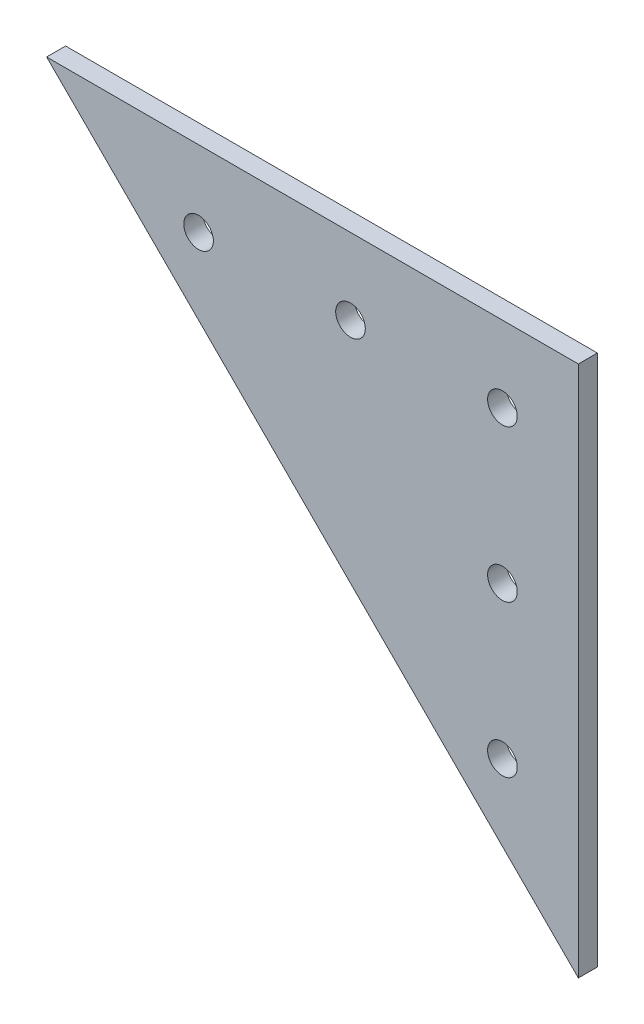
ISO-10303-21;
HEADER;
FILE_DESCRIPTION(('STEP AP214'),'2;1');
FILE_NAME('part.step','',(''),(''),'','','');
FILE_SCHEMA(('AUTOMOTIVE_DESIGN { 1 0 10303 214 1 1 1 1 }'));
ENDSEC;
DATA;
#1=APPLICATION_CONTEXT('core data for automotive mechanical design processes');
#2=APPLICATION_PROTOCOL_DEFINITION('international standard','automotive_design',2000,#1);
#3=PRODUCT_CONTEXT('',#1,'mechanical');
#4=PRODUCT('Part','Part','',(#3));
#5=PRODUCT_RELATED_PRODUCT_CATEGORY('part','',(#4));
#6=PRODUCT_DEFINITION_FORMATION('','',#4);
#7=PRODUCT_DEFINITION_CONTEXT('part definition',#1,'design');
#8=PRODUCT_DEFINITION('design','',#6,#7);
#9=PRODUCT_DEFINITION_SHAPE('','',#8);
#10=(LENGTH_UNIT() NAMED_UNIT(*) SI_UNIT(.MILLI.,.METRE.));
#11=(NAMED_UNIT(*) PLANE_ANGLE_UNIT() SI_UNIT($,.RADIAN.));
#12=(NAMED_UNIT(*) SI_UNIT($,.STERADIAN.) SOLID_ANGLE_UNIT());
#13=UNCERTAINTY_MEASURE_WITH_UNIT(LENGTH_MEASURE(1.E-05),#10,'distance_accuracy_value','');
#14=(GEOMETRIC_REPRESENTATION_CONTEXT(3) GLOBAL_UNCERTAINTY_ASSIGNED_CONTEXT((#13)) GLOBAL_UNIT_ASSIGNED_CONTEXT((#10,
#11,#12)) REPRESENTATION_CONTEXT('',''));
#15=CARTESIAN_POINT('',(0.,0.,0.));
#16=DIRECTION('',(0.,0.,1.));
#17=DIRECTION('',(1.,0.,0.));
#18=AXIS2_PLACEMENT_3D('',#15,#16,#17);
#19=CARTESIAN_POINT('',(0.,0.,1.5875));
#20=DIRECTION('',(0.,0.,-1.));
#21=DIRECTION('',(-1.,0.,0.));
#22=AXIS2_PLACEMENT_3D('',#19,#20,#21);
#23=PLANE('',#22);
#24=DIRECTION('',(0.707106781186547,-0.707106781186547,0.));
#25=VECTOR('',#24,1.);
#26=CARTESIAN_POINT('',(-44.45,44.45,1.5875));
#27=LINE('',#26,#25);
#28=CARTESIAN_POINT('',(-44.45,44.45,1.5875));
#29=VERTEX_POINT('',#28);
#30=CARTESIAN_POINT('',(44.45,-44.45,1.5875));
#31=VERTEX_POINT('',#30);
#32=EDGE_CURVE('E73',#29,#31,#27,.T.);
#33=ORIENTED_EDGE('',*,*,#32,.T.);
#34=DIRECTION('',(0.,1.,0.));
#35=VECTOR('',#34,1.);
#36=CARTESIAN_POINT('',(44.45,44.45,1.5875));
#37=LINE('',#36,#35);
#38=CARTESIAN_POINT('',(44.45,44.45,1.5875));
#39=VERTEX_POINT('',#38);
#40=EDGE_CURVE('E69',#31,#39,#37,.T.);
#41=ORIENTED_EDGE('',*,*,#40,.T.);
#42=DIRECTION('',(-1.,0.,0.));
#43=VECTOR('',#42,1.);
#44=CARTESIAN_POINT('',(-44.45,44.45,1.5875));
#45=LINE('',#44,#43);
#46=EDGE_CURVE('E49',#39,#29,#45,.T.);
#47=ORIENTED_EDGE('',*,*,#46,.T.);
#48=EDGE_LOOP('',(#33,#41,#47));
#49=FACE_BOUND('',#48,.T.);
#50=CARTESIAN_POINT('',(6.34999999999997,31.75,1.5875));
#51=DIRECTION('',(0.,0.,1.));
#52=DIRECTION('',(1.,0.,0.));
#53=AXIS2_PLACEMENT_3D('',#50,#51,#52);
#54=CIRCLE('',#53,2.4765);
#55=CARTESIAN_POINT('',(8.82649999999997,31.75,1.5875));
#56=VERTEX_POINT('',#55);
#57=EDGE_CURVE('E83',#56,#56,#54,.T.);
#58=ORIENTED_EDGE('',*,*,#57,.F.);
#59=EDGE_LOOP('',(#58));
#60=FACE_BOUND('',#59,.T.);
#61=CARTESIAN_POINT('',(31.75,31.75,1.5875));
#62=DIRECTION('',(0.,0.,1.));
#63=DIRECTION('',(1.,0.,0.));
#64=AXIS2_PLACEMENT_3D('',#61,#62,#63);
#65=CIRCLE('',#64,2.47649999999999);
#66=CARTESIAN_POINT('',(34.2265,31.75,1.5875));
#67=VERTEX_POINT('',#66);
#68=EDGE_CURVE('E125',#67,#67,#65,.T.);
#69=ORIENTED_EDGE('',*,*,#68,.F.);
#70=EDGE_LOOP('',(#69));
#71=FACE_BOUND('',#70,.T.);
#72=CARTESIAN_POINT('',(31.75,6.35,1.5875));
#73=DIRECTION('',(0.,0.,1.));
#74=DIRECTION('',(1.,0.,0.));
#75=AXIS2_PLACEMENT_3D('',#72,#73,#74);
#76=CIRCLE('',#75,2.47649999999999);
#77=CARTESIAN_POINT('',(34.2265,6.35,1.5875));
#78=VERTEX_POINT('',#77);
#79=EDGE_CURVE('E120',#78,#78,#76,.T.);
#80=ORIENTED_EDGE('',*,*,#79,.F.);
#81=EDGE_LOOP('',(#80));
#82=FACE_BOUND('',#81,.T.);
#83=CARTESIAN_POINT('',(31.75,-19.05,1.5875));
#84=DIRECTION('',(0.,0.,1.));
#85=DIRECTION('',(1.,0.,0.));
#86=AXIS2_PLACEMENT_3D('',#83,#84,#85);
#87=CIRCLE('',#86,2.4765);
#88=CARTESIAN_POINT('',(34.2265,-19.05,1.5875));
#89=VERTEX_POINT('',#88);
#90=EDGE_CURVE('E115',#89,#89,#87,.T.);
#91=ORIENTED_EDGE('',*,*,#90,.F.);
#92=EDGE_LOOP('',(#91));
#93=FACE_BOUND('',#92,.T.);
#94=CARTESIAN_POINT('',(-19.05,31.75,1.5875));
#95=DIRECTION('',(0.,0.,1.));
#96=DIRECTION('',(1.,0.,0.));
#97=AXIS2_PLACEMENT_3D('',#94,#95,#96);
#98=CIRCLE('',#97,2.4765);
#99=CARTESIAN_POINT('',(-16.5735,31.75,1.5875));
#100=VERTEX_POINT('',#99);
#101=EDGE_CURVE('E109',#100,#100,#98,.T.);
#102=ORIENTED_EDGE('',*,*,#101,.F.);
#103=EDGE_LOOP('',(#102));
#104=FACE_BOUND('',#103,.T.);
#105=ADVANCED_FACE('F32',(#49,#60,#71,#82,#93,#104),#23,.F.);
#106=CARTESIAN_POINT('',(0.,0.,-1.5875));
#107=DIRECTION('',(0.,0.,-1.));
#108=DIRECTION('',(-1.,0.,0.));
#109=AXIS2_PLACEMENT_3D('',#106,#107,#108);
#110=PLANE('',#109);
#111=CARTESIAN_POINT('',(31.75,-19.05,-1.5875));
#112=DIRECTION('',(0.,0.,1.));
#113=DIRECTION('',(1.,0.,0.));
#114=AXIS2_PLACEMENT_3D('',#111,#112,#113);
#115=CIRCLE('',#114,2.4765);
#116=CARTESIAN_POINT('',(34.2265,-19.05,-1.5875));
#117=VERTEX_POINT('',#116);
#118=EDGE_CURVE('E112',#117,#117,#115,.T.);
#119=ORIENTED_EDGE('',*,*,#118,.T.);
#120=EDGE_LOOP('',(#119));
#121=FACE_BOUND('',#120,.T.);
#122=CARTESIAN_POINT('',(31.75,31.75,-1.5875));
#123=DIRECTION('',(0.,0.,1.));
#124=DIRECTION('',(1.,0.,0.));
#125=AXIS2_PLACEMENT_3D('',#122,#123,#124);
#126=CIRCLE('',#125,2.47649999999999);
#127=CARTESIAN_POINT('',(34.2265,31.75,-1.5875));
#128=VERTEX_POINT('',#127);
#129=EDGE_CURVE('E123',#128,#128,#126,.T.);
#130=ORIENTED_EDGE('',*,*,#129,.T.);
#131=EDGE_LOOP('',(#130));
#132=FACE_BOUND('',#131,.T.);
#133=DIRECTION('',(0.707106781186547,-0.707106781186547,0.));
#134=VECTOR('',#133,1.);
#135=CARTESIAN_POINT('',(-44.45,44.45,-1.5875));
#136=LINE('',#135,#134);
#137=CARTESIAN_POINT('',(-44.45,44.45,-1.5875));
#138=VERTEX_POINT('',#137);
#139=CARTESIAN_POINT('',(44.45,-44.45,-1.5875));
#140=VERTEX_POINT('',#139);
#141=EDGE_CURVE('E80',#138,#140,#136,.T.);
#142=ORIENTED_EDGE('',*,*,#141,.F.);
#143=DIRECTION('',(-1.,0.,0.));
#144=VECTOR('',#143,1.);
#145=CARTESIAN_POINT('',(-44.45,44.45,-1.5875));
#146=LINE('',#145,#144);
#147=CARTESIAN_POINT('',(44.45,44.45,-1.5875));
#148=VERTEX_POINT('',#147);
#149=EDGE_CURVE('E66',#148,#138,#146,.T.);
#150=ORIENTED_EDGE('',*,*,#149,.F.);
#151=DIRECTION('',(0.,1.,0.));
#152=VECTOR('',#151,1.);
#153=CARTESIAN_POINT('',(44.45,44.45,-1.5875));
#154=LINE('',#153,#152);
#155=EDGE_CURVE('E61',#140,#148,#154,.T.);
#156=ORIENTED_EDGE('',*,*,#155,.F.);
#157=EDGE_LOOP('',(#142,#150,#156));
#158=FACE_BOUND('',#157,.T.);
#159=CARTESIAN_POINT('',(6.34999999999997,31.75,-1.5875));
#160=DIRECTION('',(0.,0.,1.));
#161=DIRECTION('',(1.,0.,0.));
#162=AXIS2_PLACEMENT_3D('',#159,#160,#161);
#163=CIRCLE('',#162,2.4765);
#164=CARTESIAN_POINT('',(8.82649999999997,31.75,-1.5875));
#165=VERTEX_POINT('',#164);
#166=EDGE_CURVE('E87',#165,#165,#163,.T.);
#167=ORIENTED_EDGE('',*,*,#166,.T.);
#168=EDGE_LOOP('',(#167));
#169=FACE_BOUND('',#168,.T.);
#170=CARTESIAN_POINT('',(31.75,6.35,-1.5875));
#171=DIRECTION('',(0.,0.,1.));
#172=DIRECTION('',(1.,0.,0.));
#173=AXIS2_PLACEMENT_3D('',#170,#171,#172);
#174=CIRCLE('',#173,2.47649999999999);
#175=CARTESIAN_POINT('',(34.2265,6.35,-1.5875));
#176=VERTEX_POINT('',#175);
#177=EDGE_CURVE('E104',#176,#176,#174,.T.);
#178=ORIENTED_EDGE('',*,*,#177,.T.);
#179=EDGE_LOOP('',(#178));
#180=FACE_BOUND('',#179,.T.);
#181=CARTESIAN_POINT('',(-19.05,31.75,-1.5875));
#182=DIRECTION('',(0.,0.,1.));
#183=DIRECTION('',(1.,0.,0.));
#184=AXIS2_PLACEMENT_3D('',#181,#182,#183);
#185=CIRCLE('',#184,2.4765);
#186=CARTESIAN_POINT('',(-16.5735,31.75,-1.5875));
#187=VERTEX_POINT('',#186);
#188=EDGE_CURVE('E107',#187,#187,#185,.T.);
#189=ORIENTED_EDGE('',*,*,#188,.T.);
#190=EDGE_LOOP('',(#189));
#191=FACE_BOUND('',#190,.T.);
#192=ADVANCED_FACE('F93',(#121,#132,#158,#169,#180,#191),#110,.T.);
#193=CARTESIAN_POINT('',(-44.45,44.45,1.5875));
#194=DIRECTION('',(0.707106781186548,0.707106781186548,0.));
#195=DIRECTION('',(-0.707106781186548,0.707106781186548,0.));
#196=AXIS2_PLACEMENT_3D('',#193,#194,#195);
#197=PLANE('',#196);
#198=ORIENTED_EDGE('',*,*,#141,.T.);
#199=DIRECTION('',(0.,0.,-1.));
#200=VECTOR('',#199,1.);
#201=CARTESIAN_POINT('',(44.45,-44.45,1.5875));
#202=LINE('',#201,#200);
#203=EDGE_CURVE('E11',#31,#140,#202,.T.);
#204=ORIENTED_EDGE('',*,*,#203,.F.);
#205=ORIENTED_EDGE('',*,*,#32,.F.);
#206=DIRECTION('',(0.,0.,-1.));
#207=VECTOR('',#206,1.);
#208=CARTESIAN_POINT('',(-44.45,44.45,1.5875));
#209=LINE('',#208,#207);
#210=EDGE_CURVE('E81',#29,#138,#209,.T.);
#211=ORIENTED_EDGE('',*,*,#210,.T.);
#212=EDGE_LOOP('',(#198,#204,#205,#211));
#213=FACE_BOUND('',#212,.T.);
#214=ADVANCED_FACE('F34',(#213),#197,.F.);
#215=CARTESIAN_POINT('',(44.45,44.45,1.5875));
#216=DIRECTION('',(-1.,0.,0.));
#217=DIRECTION('',(0.,0.,1.));
#218=AXIS2_PLACEMENT_3D('',#215,#216,#217);
#219=PLANE('',#218);
#220=ORIENTED_EDGE('',*,*,#155,.T.);
#221=DIRECTION('',(0.,0.,-1.));
#222=VECTOR('',#221,1.);
#223=CARTESIAN_POINT('',(44.45,44.45,1.5875));
#224=LINE('',#223,#222);
#225=EDGE_CURVE('E41',#39,#148,#224,.T.);
#226=ORIENTED_EDGE('',*,*,#225,.F.);
#227=ORIENTED_EDGE('',*,*,#40,.F.);
#228=ORIENTED_EDGE('',*,*,#203,.T.);
#229=EDGE_LOOP('',(#220,#226,#227,#228));
#230=FACE_BOUND('',#229,.T.);
#231=ADVANCED_FACE('F70',(#230),#219,.F.);
#232=CARTESIAN_POINT('',(-44.45,44.45,1.5875));
#233=DIRECTION('',(0.,-1.,0.));
#234=DIRECTION('',(0.,0.,-1.));
#235=AXIS2_PLACEMENT_3D('',#232,#233,#234);
#236=PLANE('',#235);
#237=ORIENTED_EDGE('',*,*,#149,.T.);
#238=ORIENTED_EDGE('',*,*,#210,.F.);
#239=ORIENTED_EDGE('',*,*,#46,.F.);
#240=ORIENTED_EDGE('',*,*,#225,.T.);
#241=EDGE_LOOP('',(#237,#238,#239,#240));
#242=FACE_BOUND('',#241,.T.);
#243=ADVANCED_FACE('F92',(#242),#236,.F.);
#244=CARTESIAN_POINT('',(6.34999999999997,31.75,1.5875));
#245=DIRECTION('',(0.,0.,-1.));
#246=DIRECTION('',(-1.,0.,0.));
#247=AXIS2_PLACEMENT_3D('',#244,#245,#246);
#248=CYLINDRICAL_SURFACE('',#247,2.4765);
#249=ORIENTED_EDGE('',*,*,#57,.T.);
#250=EDGE_LOOP('',(#249));
#251=FACE_BOUND('',#250,.T.);
#252=ORIENTED_EDGE('',*,*,#166,.F.);
#253=EDGE_LOOP('',(#252));
#254=FACE_BOUND('',#253,.T.);
#255=ADVANCED_FACE('F136',(#251,#254),#248,.F.);
#256=CARTESIAN_POINT('',(31.75,31.75,1.5875));
#257=DIRECTION('',(0.,0.,-1.));
#258=DIRECTION('',(-1.,0.,0.));
#259=AXIS2_PLACEMENT_3D('',#256,#257,#258);
#260=CYLINDRICAL_SURFACE('',#259,2.47649999999999);
#261=ORIENTED_EDGE('',*,*,#68,.T.);
#262=EDGE_LOOP('',(#261));
#263=FACE_BOUND('',#262,.T.);
#264=ORIENTED_EDGE('',*,*,#129,.F.);
#265=EDGE_LOOP('',(#264));
#266=FACE_BOUND('',#265,.T.);
#267=ADVANCED_FACE('F133',(#263,#266),#260,.F.);
#268=CARTESIAN_POINT('',(31.75,6.35,1.5875));
#269=DIRECTION('',(0.,0.,-1.));
#270=DIRECTION('',(-1.,0.,0.));
#271=AXIS2_PLACEMENT_3D('',#268,#269,#270);
#272=CYLINDRICAL_SURFACE('',#271,2.47649999999999);
#273=ORIENTED_EDGE('',*,*,#79,.T.);
#274=EDGE_LOOP('',(#273));
#275=FACE_BOUND('',#274,.T.);
#276=ORIENTED_EDGE('',*,*,#177,.F.);
#277=EDGE_LOOP('',(#276));
#278=FACE_BOUND('',#277,.T.);
#279=ADVANCED_FACE('F135',(#275,#278),#272,.F.);
#280=CARTESIAN_POINT('',(31.75,-19.05,1.5875));
#281=DIRECTION('',(0.,0.,-1.));
#282=DIRECTION('',(-1.,0.,0.));
#283=AXIS2_PLACEMENT_3D('',#280,#281,#282);
#284=CYLINDRICAL_SURFACE('',#283,2.4765);
#285=ORIENTED_EDGE('',*,*,#90,.T.);
#286=EDGE_LOOP('',(#285));
#287=FACE_BOUND('',#286,.T.);
#288=ORIENTED_EDGE('',*,*,#118,.F.);
#289=EDGE_LOOP('',(#288));
#290=FACE_BOUND('',#289,.T.);
#291=ADVANCED_FACE('F143',(#287,#290),#284,.F.);
#292=CARTESIAN_POINT('',(-19.05,31.75,1.5875));
#293=DIRECTION('',(0.,0.,-1.));
#294=DIRECTION('',(-1.,0.,0.));
#295=AXIS2_PLACEMENT_3D('',#292,#293,#294);
#296=CYLINDRICAL_SURFACE('',#295,2.4765);
#297=ORIENTED_EDGE('',*,*,#101,.T.);
#298=EDGE_LOOP('',(#297));
#299=FACE_BOUND('',#298,.T.);
#300=ORIENTED_EDGE('',*,*,#188,.F.);
#301=EDGE_LOOP('',(#300));
#302=FACE_BOUND('',#301,.T.);
#303=ADVANCED_FACE('F205',(#299,#302),#296,.F.);
#304=CLOSED_SHELL('',(#105,#192,#214,#231,#243,#255,#267,#279,#291,#303));
#305=MANIFOLD_SOLID_BREP('B2',#304);
#306=ADVANCED_BREP_SHAPE_REPRESENTATION('',(#18,#305),#14);
#307=SHAPE_DEFINITION_REPRESENTATION(#9,#306);
ENDSEC;
END-ISO-10303-21;
